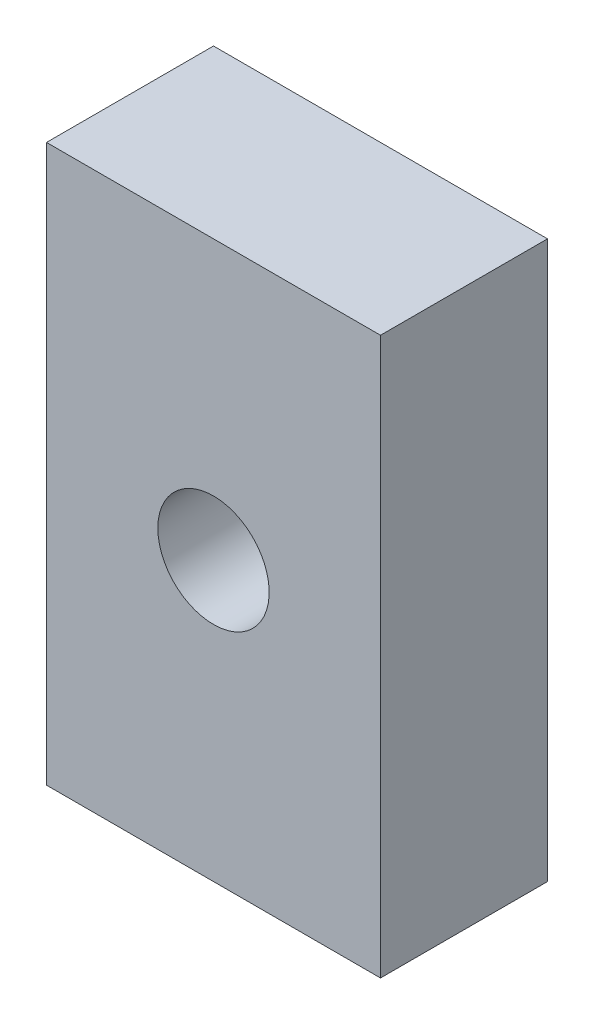
ISO-10303-21;
HEADER;
FILE_DESCRIPTION(('STEP AP214'),'2;1');
FILE_NAME('part.step','',(''),(''),'','','');
FILE_SCHEMA(('AUTOMOTIVE_DESIGN { 1 0 10303 214 1 1 1 1 }'));
ENDSEC;
DATA;
#1=APPLICATION_CONTEXT('core data for automotive mechanical design processes');
#2=APPLICATION_PROTOCOL_DEFINITION('international standard','automotive_design',2000,#1);
#3=PRODUCT_CONTEXT('',#1,'mechanical');
#4=PRODUCT('Part','Part','',(#3));
#5=PRODUCT_RELATED_PRODUCT_CATEGORY('part','',(#4));
#6=PRODUCT_DEFINITION_FORMATION('','',#4);
#7=PRODUCT_DEFINITION_CONTEXT('part definition',#1,'design');
#8=PRODUCT_DEFINITION('design','',#6,#7);
#9=PRODUCT_DEFINITION_SHAPE('','',#8);
#10=(LENGTH_UNIT() NAMED_UNIT(*) SI_UNIT(.MILLI.,.METRE.));
#11=(NAMED_UNIT(*) PLANE_ANGLE_UNIT() SI_UNIT($,.RADIAN.));
#12=(NAMED_UNIT(*) SI_UNIT($,.STERADIAN.) SOLID_ANGLE_UNIT());
#13=UNCERTAINTY_MEASURE_WITH_UNIT(LENGTH_MEASURE(1.E-05),#10,'distance_accuracy_value','');
#14=(GEOMETRIC_REPRESENTATION_CONTEXT(3) GLOBAL_UNCERTAINTY_ASSIGNED_CONTEXT((#13)) GLOBAL_UNIT_ASSIGNED_CONTEXT((#10,
#11,#12)) REPRESENTATION_CONTEXT('',''));
#15=CARTESIAN_POINT('',(0.,0.,0.));
#16=DIRECTION('',(0.,0.,1.));
#17=DIRECTION('',(1.,0.,0.));
#18=AXIS2_PLACEMENT_3D('',#15,#16,#17);
#19=CARTESIAN_POINT('',(19.05,-31.75,19.05));
#20=DIRECTION('',(-1.,0.,0.));
#21=DIRECTION('',(0.,0.,1.));
#22=AXIS2_PLACEMENT_3D('',#19,#20,#21);
#23=PLANE('',#22);
#24=DIRECTION('',(0.,1.,0.));
#25=VECTOR('',#24,1.);
#26=CARTESIAN_POINT('',(19.05,-31.75,0.));
#27=LINE('',#26,#25);
#28=CARTESIAN_POINT('',(19.05,-31.75,0.));
#29=VERTEX_POINT('',#28);
#30=CARTESIAN_POINT('',(19.05,31.75,0.));
#31=VERTEX_POINT('',#30);
#32=EDGE_CURVE('E97',#29,#31,#27,.T.);
#33=ORIENTED_EDGE('',*,*,#32,.T.);
#34=DIRECTION('',(0.,0.,-1.));
#35=VECTOR('',#34,1.);
#36=CARTESIAN_POINT('',(19.05,31.75,19.05));
#37=LINE('',#36,#35);
#38=CARTESIAN_POINT('',(19.05,31.75,19.05));
#39=VERTEX_POINT('',#38);
#40=EDGE_CURVE('E11',#39,#31,#37,.T.);
#41=ORIENTED_EDGE('',*,*,#40,.F.);
#42=DIRECTION('',(0.,1.,0.));
#43=VECTOR('',#42,1.);
#44=CARTESIAN_POINT('',(19.05,-31.75,19.05));
#45=LINE('',#44,#43);
#46=CARTESIAN_POINT('',(19.05,-31.75,19.05));
#47=VERTEX_POINT('',#46);
#48=EDGE_CURVE('E85',#47,#39,#45,.T.);
#49=ORIENTED_EDGE('',*,*,#48,.F.);
#50=DIRECTION('',(0.,0.,-1.));
#51=VECTOR('',#50,1.);
#52=CARTESIAN_POINT('',(19.05,-31.75,19.05));
#53=LINE('',#52,#51);
#54=EDGE_CURVE('E93',#47,#29,#53,.T.);
#55=ORIENTED_EDGE('',*,*,#54,.T.);
#56=EDGE_LOOP('',(#33,#41,#49,#55));
#57=FACE_BOUND('',#56,.T.);
#58=ADVANCED_FACE('F34',(#57),#23,.F.);
#59=CARTESIAN_POINT('',(-19.05,31.75,19.05));
#60=DIRECTION('',(0.,-1.,0.));
#61=DIRECTION('',(0.,0.,-1.));
#62=AXIS2_PLACEMENT_3D('',#59,#60,#61);
#63=PLANE('',#62);
#64=DIRECTION('',(-1.,0.,0.));
#65=VECTOR('',#64,1.);
#66=CARTESIAN_POINT('',(-19.05,31.75,0.));
#67=LINE('',#66,#65);
#68=CARTESIAN_POINT('',(-19.05,31.75,0.));
#69=VERTEX_POINT('',#68);
#70=EDGE_CURVE('E89',#31,#69,#67,.T.);
#71=ORIENTED_EDGE('',*,*,#70,.T.);
#72=DIRECTION('',(0.,0.,-1.));
#73=VECTOR('',#72,1.);
#74=CARTESIAN_POINT('',(-19.05,31.75,19.05));
#75=LINE('',#74,#73);
#76=CARTESIAN_POINT('',(-19.05,31.75,19.05));
#77=VERTEX_POINT('',#76);
#78=EDGE_CURVE('E42',#77,#69,#75,.T.);
#79=ORIENTED_EDGE('',*,*,#78,.F.);
#80=DIRECTION('',(-1.,0.,0.));
#81=VECTOR('',#80,1.);
#82=CARTESIAN_POINT('',(-19.05,31.75,19.05));
#83=LINE('',#82,#81);
#84=EDGE_CURVE('E80',#39,#77,#83,.T.);
#85=ORIENTED_EDGE('',*,*,#84,.F.);
#86=ORIENTED_EDGE('',*,*,#40,.T.);
#87=EDGE_LOOP('',(#71,#79,#85,#86));
#88=FACE_BOUND('',#87,.T.);
#89=ADVANCED_FACE('F88',(#88),#63,.F.);
#90=CARTESIAN_POINT('',(-19.05,-31.75,19.05));
#91=DIRECTION('',(1.,0.,0.));
#92=DIRECTION('',(0.,0.,-1.));
#93=AXIS2_PLACEMENT_3D('',#90,#91,#92);
#94=PLANE('',#93);
#95=DIRECTION('',(0.,-1.,0.));
#96=VECTOR('',#95,1.);
#97=CARTESIAN_POINT('',(-19.05,-31.75,0.));
#98=LINE('',#97,#96);
#99=CARTESIAN_POINT('',(-19.05,-31.75,0.));
#100=VERTEX_POINT('',#99);
#101=EDGE_CURVE('E67',#69,#100,#98,.T.);
#102=ORIENTED_EDGE('',*,*,#101,.T.);
#103=DIRECTION('',(0.,0.,-1.));
#104=VECTOR('',#103,1.);
#105=CARTESIAN_POINT('',(-19.05,-31.75,19.05));
#106=LINE('',#105,#104);
#107=CARTESIAN_POINT('',(-19.05,-31.75,19.05));
#108=VERTEX_POINT('',#107);
#109=EDGE_CURVE('E90',#108,#100,#106,.T.);
#110=ORIENTED_EDGE('',*,*,#109,.F.);
#111=DIRECTION('',(0.,-1.,0.));
#112=VECTOR('',#111,1.);
#113=CARTESIAN_POINT('',(-19.05,-31.75,19.05));
#114=LINE('',#113,#112);
#115=EDGE_CURVE('E83',#77,#108,#114,.T.);
#116=ORIENTED_EDGE('',*,*,#115,.F.);
#117=ORIENTED_EDGE('',*,*,#78,.T.);
#118=EDGE_LOOP('',(#102,#110,#116,#117));
#119=FACE_BOUND('',#118,.T.);
#120=ADVANCED_FACE('F91',(#119),#94,.F.);
#121=CARTESIAN_POINT('',(-19.05,-31.75,19.05));
#122=DIRECTION('',(0.,1.,0.));
#123=DIRECTION('',(0.,0.,1.));
#124=AXIS2_PLACEMENT_3D('',#121,#122,#123);
#125=PLANE('',#124);
#126=DIRECTION('',(1.,0.,0.));
#127=VECTOR('',#126,1.);
#128=CARTESIAN_POINT('',(-19.05,-31.75,0.));
#129=LINE('',#128,#127);
#130=EDGE_CURVE('E73',#100,#29,#129,.T.);
#131=ORIENTED_EDGE('',*,*,#130,.T.);
#132=ORIENTED_EDGE('',*,*,#54,.F.);
#133=DIRECTION('',(1.,0.,0.));
#134=VECTOR('',#133,1.);
#135=CARTESIAN_POINT('',(-19.05,-31.75,19.05));
#136=LINE('',#135,#134);
#137=EDGE_CURVE('E50',#108,#47,#136,.T.);
#138=ORIENTED_EDGE('',*,*,#137,.F.);
#139=ORIENTED_EDGE('',*,*,#109,.T.);
#140=EDGE_LOOP('',(#131,#132,#138,#139));
#141=FACE_BOUND('',#140,.T.);
#142=ADVANCED_FACE('F105',(#141),#125,.F.);
#143=CARTESIAN_POINT('',(19.05,31.75,19.05));
#144=DIRECTION('',(0.,0.,-1.));
#145=DIRECTION('',(-1.,0.,0.));
#146=AXIS2_PLACEMENT_3D('',#143,#144,#145);
#147=PLANE('',#146);
#148=CARTESIAN_POINT('',(0.,0.,19.05));
#149=DIRECTION('',(0.,0.,-1.));
#150=DIRECTION('',(-1.,0.,0.));
#151=AXIS2_PLACEMENT_3D('',#148,#149,#150);
#152=CIRCLE('',#151,6.35);
#153=CARTESIAN_POINT('',(-6.35,0.,19.05));
#154=VERTEX_POINT('',#153);
#155=EDGE_CURVE('E100',#154,#154,#152,.T.);
#156=ORIENTED_EDGE('',*,*,#155,.T.);
#157=EDGE_LOOP('',(#156));
#158=FACE_BOUND('',#157,.T.);
#159=ORIENTED_EDGE('',*,*,#48,.T.);
#160=ORIENTED_EDGE('',*,*,#84,.T.);
#161=ORIENTED_EDGE('',*,*,#115,.T.);
#162=ORIENTED_EDGE('',*,*,#137,.T.);
#163=EDGE_LOOP('',(#159,#160,#161,#162));
#164=FACE_BOUND('',#163,.T.);
#165=ADVANCED_FACE('F81',(#158,#164),#147,.F.);
#166=CARTESIAN_POINT('',(19.05,31.75,0.));
#167=DIRECTION('',(0.,0.,-1.));
#168=DIRECTION('',(-1.,0.,0.));
#169=AXIS2_PLACEMENT_3D('',#166,#167,#168);
#170=PLANE('',#169);
#171=CARTESIAN_POINT('',(0.,0.,0.));
#172=DIRECTION('',(0.,0.,-1.));
#173=DIRECTION('',(-1.,0.,0.));
#174=AXIS2_PLACEMENT_3D('',#171,#172,#173);
#175=CIRCLE('',#174,6.34999999999999);
#176=CARTESIAN_POINT('',(-6.34999999999999,0.,0.));
#177=VERTEX_POINT('',#176);
#178=EDGE_CURVE('E113',#177,#177,#175,.T.);
#179=ORIENTED_EDGE('',*,*,#178,.F.);
#180=EDGE_LOOP('',(#179));
#181=FACE_BOUND('',#180,.T.);
#182=ORIENTED_EDGE('',*,*,#32,.F.);
#183=ORIENTED_EDGE('',*,*,#130,.F.);
#184=ORIENTED_EDGE('',*,*,#101,.F.);
#185=ORIENTED_EDGE('',*,*,#70,.F.);
#186=EDGE_LOOP('',(#182,#183,#184,#185));
#187=FACE_BOUND('',#186,.T.);
#188=ADVANCED_FACE('F108',(#181,#187),#170,.T.);
#189=CARTESIAN_POINT('',(0.,0.,0.));
#190=DIRECTION('',(0.,0.,-1.));
#191=DIRECTION('',(-1.,0.,0.));
#192=AXIS2_PLACEMENT_3D('',#189,#190,#191);
#193=CYLINDRICAL_SURFACE('',#192,6.34999999999999);
#194=ORIENTED_EDGE('',*,*,#155,.F.);
#195=EDGE_LOOP('',(#194));
#196=FACE_BOUND('',#195,.T.);
#197=ORIENTED_EDGE('',*,*,#178,.T.);
#198=EDGE_LOOP('',(#197));
#199=FACE_BOUND('',#198,.T.);
#200=ADVANCED_FACE('F117',(#196,#199),#193,.F.);
#201=CLOSED_SHELL('',(#58,#89,#120,#142,#165,#188,#200));
#202=MANIFOLD_SOLID_BREP('B2',#201);
#203=ADVANCED_BREP_SHAPE_REPRESENTATION('',(#18,#202),#14);
#204=SHAPE_DEFINITION_REPRESENTATION(#9,#203);
ENDSEC;
END-ISO-10303-21;
